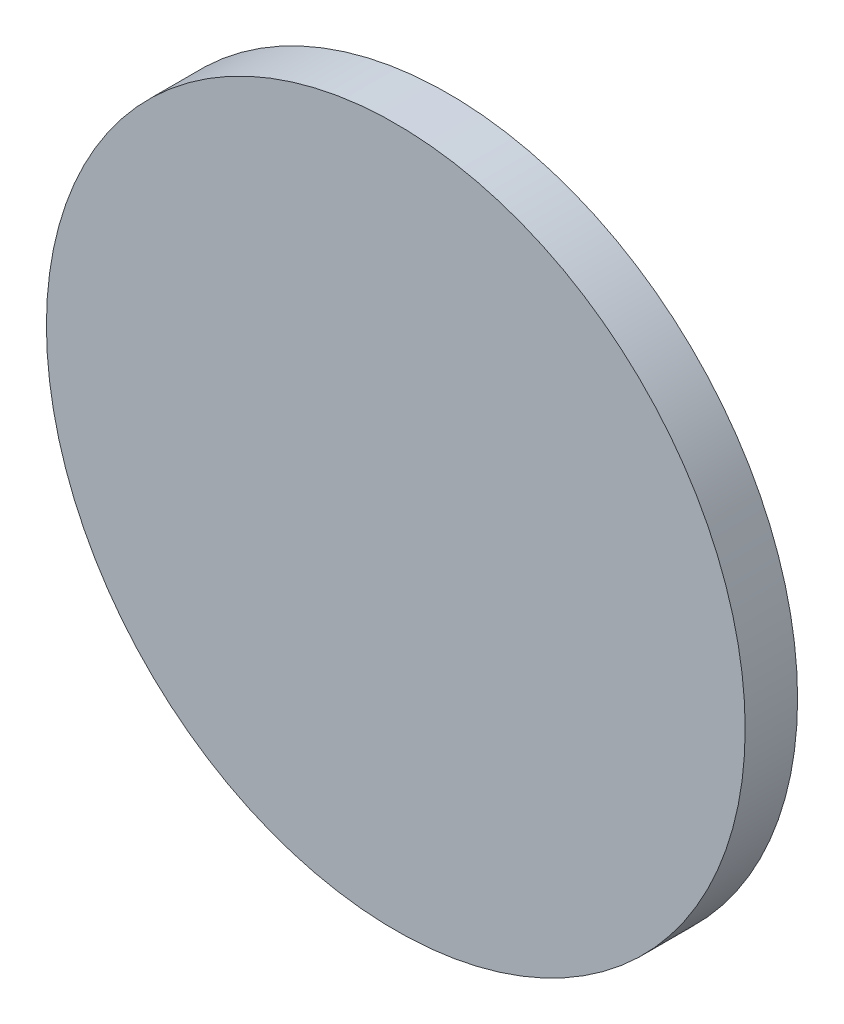
ISO-10303-21;
HEADER;
FILE_DESCRIPTION(('STEP AP214'),'2;1');
FILE_NAME('part.step','',(''),(''),'','','');
FILE_SCHEMA(('AUTOMOTIVE_DESIGN { 1 0 10303 214 1 1 1 1 }'));
ENDSEC;
DATA;
#1=APPLICATION_CONTEXT('core data for automotive mechanical design processes');
#2=APPLICATION_PROTOCOL_DEFINITION('international standard','automotive_design',2000,#1);
#3=PRODUCT_CONTEXT('',#1,'mechanical');
#4=PRODUCT('Part','Part','',(#3));
#5=PRODUCT_RELATED_PRODUCT_CATEGORY('part','',(#4));
#6=PRODUCT_DEFINITION_FORMATION('','',#4);
#7=PRODUCT_DEFINITION_CONTEXT('part definition',#1,'design');
#8=PRODUCT_DEFINITION('design','',#6,#7);
#9=PRODUCT_DEFINITION_SHAPE('','',#8);
#10=(LENGTH_UNIT() NAMED_UNIT(*) SI_UNIT(.MILLI.,.METRE.));
#11=(NAMED_UNIT(*) PLANE_ANGLE_UNIT() SI_UNIT($,.RADIAN.));
#12=(NAMED_UNIT(*) SI_UNIT($,.STERADIAN.) SOLID_ANGLE_UNIT());
#13=UNCERTAINTY_MEASURE_WITH_UNIT(LENGTH_MEASURE(1.E-05),#10,'distance_accuracy_value','');
#14=(GEOMETRIC_REPRESENTATION_CONTEXT(3) GLOBAL_UNCERTAINTY_ASSIGNED_CONTEXT((#13)) GLOBAL_UNIT_ASSIGNED_CONTEXT((#10,
#11,#12)) REPRESENTATION_CONTEXT('',''));
#15=CARTESIAN_POINT('',(0.,0.,0.));
#16=DIRECTION('',(0.,0.,1.));
#17=DIRECTION('',(1.,0.,0.));
#18=AXIS2_PLACEMENT_3D('',#15,#16,#17);
#19=CARTESIAN_POINT('',(0.,0.,3.));
#20=DIRECTION('',(0.,0.,-1.));
#21=DIRECTION('',(-1.,0.,0.));
#22=AXIS2_PLACEMENT_3D('',#19,#20,#21);
#23=CYLINDRICAL_SURFACE('',#22,20.);
#24=CARTESIAN_POINT('',(0.,0.,3.));
#25=DIRECTION('',(0.,0.,1.));
#26=DIRECTION('',(1.,0.,0.));
#27=AXIS2_PLACEMENT_3D('',#24,#25,#26);
#28=CIRCLE('',#27,20.);
#29=CARTESIAN_POINT('',(20.,0.,3.));
#30=VERTEX_POINT('',#29);
#31=EDGE_CURVE('E10',#30,#30,#28,.T.);
#32=ORIENTED_EDGE('',*,*,#31,.F.);
#33=EDGE_LOOP('',(#32));
#34=FACE_BOUND('',#33,.T.);
#35=CARTESIAN_POINT('',(0.,0.,0.));
#36=DIRECTION('',(0.,0.,1.));
#37=DIRECTION('',(1.,0.,0.));
#38=AXIS2_PLACEMENT_3D('',#35,#36,#37);
#39=CIRCLE('',#38,20.);
#40=CARTESIAN_POINT('',(20.,0.,0.));
#41=VERTEX_POINT('',#40);
#42=EDGE_CURVE('E38',#41,#41,#39,.T.);
#43=ORIENTED_EDGE('',*,*,#42,.T.);
#44=EDGE_LOOP('',(#43));
#45=FACE_BOUND('',#44,.T.);
#46=ADVANCED_FACE('F35',(#34,#45),#23,.T.);
#47=CARTESIAN_POINT('',(0.,0.,3.));
#48=DIRECTION('',(0.,0.,1.));
#49=DIRECTION('',(1.,0.,0.));
#50=AXIS2_PLACEMENT_3D('',#47,#48,#49);
#51=PLANE('',#50);
#52=ORIENTED_EDGE('',*,*,#31,.T.);
#53=EDGE_LOOP('',(#52));
#54=FACE_BOUND('',#53,.T.);
#55=ADVANCED_FACE('F50',(#54),#51,.T.);
#56=CARTESIAN_POINT('',(0.,0.,0.));
#57=DIRECTION('',(0.,0.,1.));
#58=DIRECTION('',(1.,0.,0.));
#59=AXIS2_PLACEMENT_3D('',#56,#57,#58);
#60=PLANE('',#59);
#61=ORIENTED_EDGE('',*,*,#42,.F.);
#62=EDGE_LOOP('',(#61));
#63=FACE_BOUND('',#62,.T.);
#64=ADVANCED_FACE('F48',(#63),#60,.F.);
#65=CLOSED_SHELL('',(#46,#55,#64));
#66=MANIFOLD_SOLID_BREP('B2',#65);
#67=ADVANCED_BREP_SHAPE_REPRESENTATION('',(#18,#66),#14);
#68=SHAPE_DEFINITION_REPRESENTATION(#9,#67);
ENDSEC;
END-ISO-10303-21;
